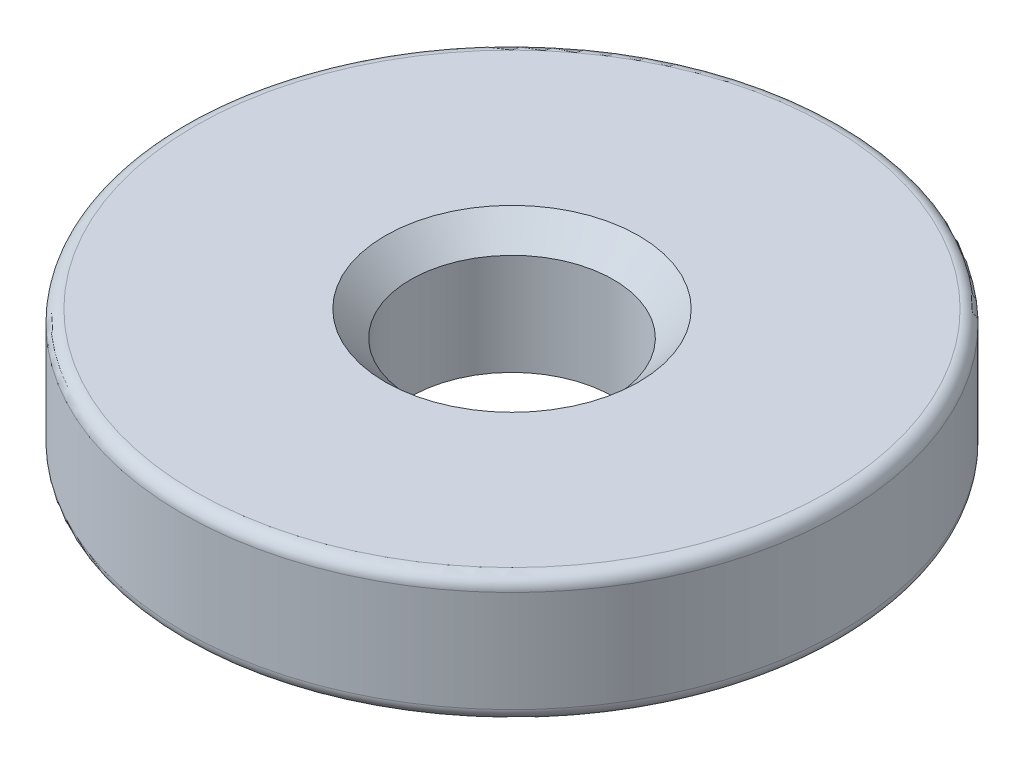
ISO-10303-21;
HEADER;
FILE_DESCRIPTION(('STEP AP214'),'2;1');
FILE_NAME('part.step','',(''),(''),'','','');
FILE_SCHEMA(('AUTOMOTIVE_DESIGN { 1 0 10303 214 1 1 1 1 }'));
ENDSEC;
DATA;
#1=APPLICATION_CONTEXT('core data for automotive mechanical design processes');
#2=APPLICATION_PROTOCOL_DEFINITION('international standard','automotive_design',2000,#1);
#3=PRODUCT_CONTEXT('',#1,'mechanical');
#4=PRODUCT('Part','Part','',(#3));
#5=PRODUCT_RELATED_PRODUCT_CATEGORY('part','',(#4));
#6=PRODUCT_DEFINITION_FORMATION('','',#4);
#7=PRODUCT_DEFINITION_CONTEXT('part definition',#1,'design');
#8=PRODUCT_DEFINITION('design','',#6,#7);
#9=PRODUCT_DEFINITION_SHAPE('','',#8);
#10=(LENGTH_UNIT() NAMED_UNIT(*) SI_UNIT(.MILLI.,.METRE.));
#11=(NAMED_UNIT(*) PLANE_ANGLE_UNIT() SI_UNIT($,.RADIAN.));
#12=(NAMED_UNIT(*) SI_UNIT($,.STERADIAN.) SOLID_ANGLE_UNIT());
#13=UNCERTAINTY_MEASURE_WITH_UNIT(LENGTH_MEASURE(1.E-05),#10,'distance_accuracy_value','');
#14=(GEOMETRIC_REPRESENTATION_CONTEXT(3) GLOBAL_UNCERTAINTY_ASSIGNED_CONTEXT((#13)) GLOBAL_UNIT_ASSIGNED_CONTEXT((#10,
#11,#12)) REPRESENTATION_CONTEXT('',''));
#15=CARTESIAN_POINT('',(0.,0.,0.));
#16=DIRECTION('',(0.,0.,1.));
#17=DIRECTION('',(1.,0.,0.));
#18=AXIS2_PLACEMENT_3D('',#15,#16,#17);
#19=CARTESIAN_POINT('',(0.,5.,0.));
#20=DIRECTION('',(0.,1.,0.));
#21=DIRECTION('',(0.,0.,1.));
#22=AXIS2_PLACEMENT_3D('',#19,#20,#21);
#23=PLANE('',#22);
#24=CARTESIAN_POINT('',(0.,5.,0.));
#25=DIRECTION('',(0.,1.,0.));
#26=DIRECTION('',(0.,0.,1.));
#27=AXIS2_PLACEMENT_3D('',#24,#25,#26);
#28=CIRCLE('',#27,12.5);
#29=CARTESIAN_POINT('',(0.,5.,12.5));
#30=VERTEX_POINT('',#29);
#31=EDGE_CURVE('E10',#30,#30,#28,.T.);
#32=ORIENTED_EDGE('',*,*,#31,.T.);
#33=EDGE_LOOP('',(#32));
#34=FACE_BOUND('',#33,.T.);
#35=CARTESIAN_POINT('',(0.,5.,0.));
#36=DIRECTION('',(0.,1.,0.));
#37=DIRECTION('',(0.,0.,1.));
#38=AXIS2_PLACEMENT_3D('',#35,#36,#37);
#39=CIRCLE('',#38,4.99999999999999);
#40=CARTESIAN_POINT('',(0.,5.,4.99999999999999));
#41=VERTEX_POINT('',#40);
#42=EDGE_CURVE('E65',#41,#41,#39,.F.);
#43=ORIENTED_EDGE('',*,*,#42,.T.);
#44=EDGE_LOOP('',(#43));
#45=FACE_BOUND('',#44,.T.);
#46=ADVANCED_FACE('F41',(#34,#45),#23,.T.);
#47=CARTESIAN_POINT('',(0.,0.,0.));
#48=DIRECTION('',(0.,1.,0.));
#49=DIRECTION('',(0.,0.,1.));
#50=AXIS2_PLACEMENT_3D('',#47,#48,#49);
#51=PLANE('',#50);
#52=CARTESIAN_POINT('',(0.,0.,0.));
#53=DIRECTION('',(0.,1.,0.));
#54=DIRECTION('',(0.,0.,1.));
#55=AXIS2_PLACEMENT_3D('',#52,#53,#54);
#56=CIRCLE('',#55,12.5);
#57=CARTESIAN_POINT('',(0.,0.,12.5));
#58=VERTEX_POINT('',#57);
#59=EDGE_CURVE('E49',#58,#58,#56,.F.);
#60=ORIENTED_EDGE('',*,*,#59,.T.);
#61=EDGE_LOOP('',(#60));
#62=FACE_BOUND('',#61,.T.);
#63=CARTESIAN_POINT('',(0.,0.,0.));
#64=DIRECTION('',(0.,1.,0.));
#65=DIRECTION('',(0.,0.,1.));
#66=AXIS2_PLACEMENT_3D('',#63,#64,#65);
#67=CIRCLE('',#66,4.);
#68=CARTESIAN_POINT('',(0.,0.,4.));
#69=VERTEX_POINT('',#68);
#70=EDGE_CURVE('E73',#69,#69,#67,.T.);
#71=ORIENTED_EDGE('',*,*,#70,.T.);
#72=EDGE_LOOP('',(#71));
#73=FACE_BOUND('',#72,.T.);
#74=ADVANCED_FACE('F78',(#62,#73),#51,.F.);
#75=CARTESIAN_POINT('',(0.,5.,0.));
#76=DIRECTION('',(0.,-1.,0.));
#77=DIRECTION('',(0.,0.,-1.));
#78=AXIS2_PLACEMENT_3D('',#75,#76,#77);
#79=CYLINDRICAL_SURFACE('',#78,13.);
#80=CARTESIAN_POINT('',(0.,0.5,0.));
#81=DIRECTION('',(0.,1.,0.));
#82=DIRECTION('',(0.,0.,1.));
#83=AXIS2_PLACEMENT_3D('',#80,#81,#82);
#84=CIRCLE('',#83,13.);
#85=CARTESIAN_POINT('',(0.,0.5,13.));
#86=VERTEX_POINT('',#85);
#87=EDGE_CURVE('E54',#86,#86,#84,.T.);
#88=ORIENTED_EDGE('',*,*,#87,.T.);
#89=EDGE_LOOP('',(#88));
#90=FACE_BOUND('',#89,.T.);
#91=CARTESIAN_POINT('',(0.,4.5,0.));
#92=DIRECTION('',(0.,1.,0.));
#93=DIRECTION('',(0.,0.,1.));
#94=AXIS2_PLACEMENT_3D('',#91,#92,#93);
#95=CIRCLE('',#94,13.);
#96=CARTESIAN_POINT('',(0.,4.5,13.));
#97=VERTEX_POINT('',#96);
#98=EDGE_CURVE('E59',#97,#97,#95,.F.);
#99=ORIENTED_EDGE('',*,*,#98,.T.);
#100=EDGE_LOOP('',(#99));
#101=FACE_BOUND('',#100,.T.);
#102=ADVANCED_FACE('F83',(#90,#101),#79,.T.);
#103=CARTESIAN_POINT('',(0.,5.,0.));
#104=DIRECTION('',(0.,-1.,0.));
#105=DIRECTION('',(0.,0.,-1.));
#106=AXIS2_PLACEMENT_3D('',#103,#104,#105);
#107=CYLINDRICAL_SURFACE('',#106,4.);
#108=CARTESIAN_POINT('',(0.,4.00000000000001,0.));
#109=DIRECTION('',(0.,1.,0.));
#110=DIRECTION('',(0.,0.,1.));
#111=AXIS2_PLACEMENT_3D('',#108,#109,#110);
#112=CIRCLE('',#111,4.);
#113=CARTESIAN_POINT('',(0.,4.00000000000001,4.));
#114=VERTEX_POINT('',#113);
#115=EDGE_CURVE('E69',#114,#114,#112,.T.);
#116=ORIENTED_EDGE('',*,*,#115,.T.);
#117=EDGE_LOOP('',(#116));
#118=FACE_BOUND('',#117,.T.);
#119=ORIENTED_EDGE('',*,*,#70,.F.);
#120=EDGE_LOOP('',(#119));
#121=FACE_BOUND('',#120,.T.);
#122=ADVANCED_FACE('F80',(#118,#121),#107,.F.);
#123=CARTESIAN_POINT('',(0.,4.00000000000001,0.));
#124=DIRECTION('',(0.,1.,0.));
#125=DIRECTION('',(0.,0.,1.));
#126=AXIS2_PLACEMENT_3D('',#123,#124,#125);
#127=CONICAL_SURFACE('',#126,4.,0.78539816339745);
#128=ORIENTED_EDGE('',*,*,#42,.F.);
#129=EDGE_LOOP('',(#128));
#130=FACE_BOUND('',#129,.T.);
#131=ORIENTED_EDGE('',*,*,#115,.F.);
#132=EDGE_LOOP('',(#131));
#133=FACE_BOUND('',#132,.T.);
#134=ADVANCED_FACE('F82',(#130,#133),#127,.F.);
#135=CARTESIAN_POINT('',(0.,0.5,0.));
#136=DIRECTION('',(0.,1.,0.));
#137=DIRECTION('',(0.,0.,1.));
#138=AXIS2_PLACEMENT_3D('',#135,#136,#137);
#139=TOROIDAL_SURFACE('',#138,12.5,0.5);
#140=ORIENTED_EDGE('',*,*,#59,.F.);
#141=EDGE_LOOP('',(#140));
#142=FACE_BOUND('',#141,.T.);
#143=ORIENTED_EDGE('',*,*,#87,.F.);
#144=EDGE_LOOP('',(#143));
#145=FACE_BOUND('',#144,.T.);
#146=ADVANCED_FACE('F90',(#142,#145),#139,.T.);
#147=CARTESIAN_POINT('',(0.,4.5,0.));
#148=DIRECTION('',(0.,1.,0.));
#149=DIRECTION('',(0.,0.,1.));
#150=AXIS2_PLACEMENT_3D('',#147,#148,#149);
#151=TOROIDAL_SURFACE('',#150,12.5,0.5);
#152=ORIENTED_EDGE('',*,*,#98,.F.);
#153=EDGE_LOOP('',(#152));
#154=FACE_BOUND('',#153,.T.);
#155=ORIENTED_EDGE('',*,*,#31,.F.);
#156=EDGE_LOOP('',(#155));
#157=FACE_BOUND('',#156,.T.);
#158=ADVANCED_FACE('F43',(#154,#157),#151,.T.);
#159=CLOSED_SHELL('',(#46,#74,#102,#122,#134,#146,#158));
#160=MANIFOLD_SOLID_BREP('B2',#159);
#161=ADVANCED_BREP_SHAPE_REPRESENTATION('',(#18,#160),#14);
#162=SHAPE_DEFINITION_REPRESENTATION(#9,#161);
ENDSEC;
END-ISO-10303-21;
